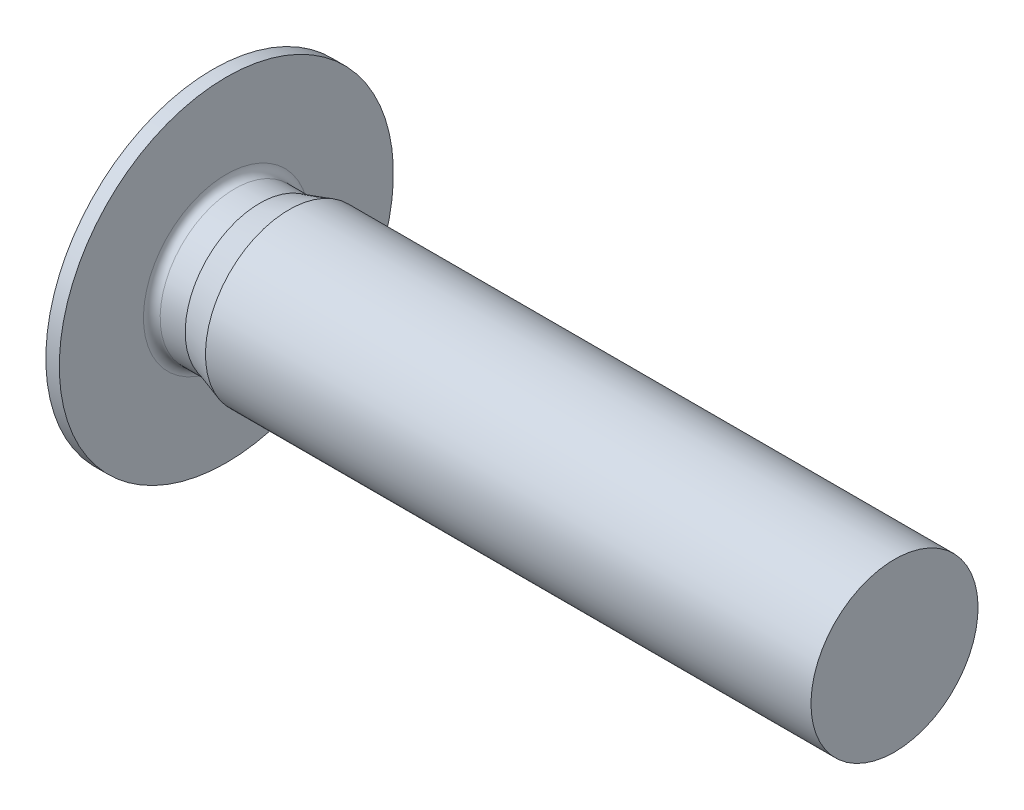
ISO-10303-21;
HEADER;
FILE_DESCRIPTION(('STEP AP214'),'2;1');
FILE_NAME('part.step','',(''),(''),'','','');
FILE_SCHEMA(('AUTOMOTIVE_DESIGN { 1 0 10303 214 1 1 1 1 }'));
ENDSEC;
DATA;
#1=APPLICATION_CONTEXT('core data for automotive mechanical design processes');
#2=APPLICATION_PROTOCOL_DEFINITION('international standard','automotive_design',2000,#1);
#3=PRODUCT_CONTEXT('',#1,'mechanical');
#4=PRODUCT('Part','Part','',(#3));
#5=PRODUCT_RELATED_PRODUCT_CATEGORY('part','',(#4));
#6=PRODUCT_DEFINITION_FORMATION('','',#4);
#7=PRODUCT_DEFINITION_CONTEXT('part definition',#1,'design');
#8=PRODUCT_DEFINITION('design','',#6,#7);
#9=PRODUCT_DEFINITION_SHAPE('','',#8);
#10=(LENGTH_UNIT() NAMED_UNIT(*) SI_UNIT(.MILLI.,.METRE.));
#11=(NAMED_UNIT(*) PLANE_ANGLE_UNIT() SI_UNIT($,.RADIAN.));
#12=(NAMED_UNIT(*) SI_UNIT($,.STERADIAN.) SOLID_ANGLE_UNIT());
#13=UNCERTAINTY_MEASURE_WITH_UNIT(LENGTH_MEASURE(1.E-05),#10,'distance_accuracy_value','');
#14=(GEOMETRIC_REPRESENTATION_CONTEXT(3) GLOBAL_UNCERTAINTY_ASSIGNED_CONTEXT((#13)) GLOBAL_UNIT_ASSIGNED_CONTEXT((#10,
#11,#12)) REPRESENTATION_CONTEXT('',''));
#15=CARTESIAN_POINT('',(0.,0.,0.));
#16=DIRECTION('',(0.,0.,1.));
#17=DIRECTION('',(1.,0.,0.));
#18=AXIS2_PLACEMENT_3D('',#15,#16,#17);
#19=CARTESIAN_POINT('',(1.6,0.,0.));
#20=DIRECTION('',(-1.,0.,0.));
#21=DIRECTION('',(0.,0.,1.));
#22=AXIS2_PLACEMENT_3D('',#19,#20,#21);
#23=PLANE('',#22);
#24=CARTESIAN_POINT('',(1.6,0.,0.));
#25=DIRECTION('',(-1.,0.,0.));
#26=DIRECTION('',(0.,-1.,0.));
#27=AXIS2_PLACEMENT_3D('',#24,#25,#26);
#28=CIRCLE('',#27,1.);
#29=CARTESIAN_POINT('',(1.6,-0.866025403784439,0.5));
#30=VERTEX_POINT('',#29);
#31=CARTESIAN_POINT('',(1.6,0.,1.));
#32=VERTEX_POINT('',#31);
#33=EDGE_CURVE('E47',#30,#32,#28,.T.);
#34=ORIENTED_EDGE('',*,*,#33,.F.);
#35=DIRECTION('',(0.,0.5,0.866025403784439));
#36=VECTOR('',#35,1.);
#37=CARTESIAN_POINT('',(1.6,-1.15470053837925,0.));
#38=LINE('',#37,#36);
#39=CARTESIAN_POINT('',(1.6,-0.577350269189627,1.));
#40=VERTEX_POINT('',#39);
#41=EDGE_CURVE('E262',#30,#40,#38,.T.);
#42=ORIENTED_EDGE('',*,*,#41,.T.);
#43=DIRECTION('',(0.,1.,0.));
#44=VECTOR('',#43,1.);
#45=CARTESIAN_POINT('',(1.6,-0.577350269189627,1.));
#46=LINE('',#45,#44);
#47=EDGE_CURVE('E230',#40,#32,#46,.T.);
#48=ORIENTED_EDGE('',*,*,#47,.T.);
#49=EDGE_LOOP('',(#34,#42,#48));
#50=FACE_BOUND('',#49,.T.);
#51=ADVANCED_FACE('F36',(#50),#23,.T.);
#52=CARTESIAN_POINT('',(1.6,0.866025403784439,0.5));
#53=VERTEX_POINT('',#52);
#54=EDGE_CURVE('E11',#32,#53,#28,.T.);
#55=ORIENTED_EDGE('',*,*,#54,.F.);
#56=CARTESIAN_POINT('',(1.6,0.577350269189626,1.));
#57=VERTEX_POINT('',#56);
#58=EDGE_CURVE('E255',#32,#57,#46,.T.);
#59=ORIENTED_EDGE('',*,*,#58,.T.);
#60=DIRECTION('',(0.,0.5,-0.866025403784439));
#61=VECTOR('',#60,1.);
#62=CARTESIAN_POINT('',(1.6,0.577350269189626,1.));
#63=LINE('',#62,#61);
#64=EDGE_CURVE('E276',#57,#53,#63,.T.);
#65=ORIENTED_EDGE('',*,*,#64,.T.);
#66=EDGE_LOOP('',(#55,#59,#65));
#67=FACE_BOUND('',#66,.T.);
#68=ADVANCED_FACE('F123',(#67),#23,.T.);
#69=CARTESIAN_POINT('',(1.6,0.866025403784439,-0.5));
#70=VERTEX_POINT('',#69);
#71=EDGE_CURVE('E45',#53,#70,#28,.T.);
#72=ORIENTED_EDGE('',*,*,#71,.F.);
#73=CARTESIAN_POINT('',(1.6,1.15470053837925,0.));
#74=VERTEX_POINT('',#73);
#75=EDGE_CURVE('E243',#53,#74,#63,.T.);
#76=ORIENTED_EDGE('',*,*,#75,.T.);
#77=DIRECTION('',(0.,-0.5,-0.866025403784439));
#78=VECTOR('',#77,1.);
#79=CARTESIAN_POINT('',(1.6,1.15470053837925,0.));
#80=LINE('',#79,#78);
#81=EDGE_CURVE('E273',#74,#70,#80,.T.);
#82=ORIENTED_EDGE('',*,*,#81,.T.);
#83=EDGE_LOOP('',(#72,#76,#82));
#84=FACE_BOUND('',#83,.T.);
#85=ADVANCED_FACE('F128',(#84),#23,.T.);
#86=CARTESIAN_POINT('',(1.6,0.,-1.));
#87=VERTEX_POINT('',#86);
#88=EDGE_CURVE('E221',#70,#87,#28,.T.);
#89=ORIENTED_EDGE('',*,*,#88,.F.);
#90=CARTESIAN_POINT('',(1.6,0.577350269189626,-1.));
#91=VERTEX_POINT('',#90);
#92=EDGE_CURVE('E275',#70,#91,#80,.T.);
#93=ORIENTED_EDGE('',*,*,#92,.T.);
#94=DIRECTION('',(0.,-1.,0.));
#95=VECTOR('',#94,1.);
#96=CARTESIAN_POINT('',(1.6,0.577350269189626,-1.));
#97=LINE('',#96,#95);
#98=EDGE_CURVE('E269',#91,#87,#97,.T.);
#99=ORIENTED_EDGE('',*,*,#98,.T.);
#100=EDGE_LOOP('',(#89,#93,#99));
#101=FACE_BOUND('',#100,.T.);
#102=ADVANCED_FACE('F187',(#101),#23,.T.);
#103=CARTESIAN_POINT('',(1.6,-0.866025403784439,-0.5));
#104=VERTEX_POINT('',#103);
#105=EDGE_CURVE('E54',#87,#104,#28,.T.);
#106=ORIENTED_EDGE('',*,*,#105,.F.);
#107=CARTESIAN_POINT('',(1.6,-0.577350269189626,-1.));
#108=VERTEX_POINT('',#107);
#109=EDGE_CURVE('E272',#87,#108,#97,.T.);
#110=ORIENTED_EDGE('',*,*,#109,.T.);
#111=DIRECTION('',(0.,-0.5,0.866025403784438));
#112=VECTOR('',#111,1.);
#113=CARTESIAN_POINT('',(1.6,-0.577350269189626,-1.));
#114=LINE('',#113,#112);
#115=EDGE_CURVE('E264',#108,#104,#114,.T.);
#116=ORIENTED_EDGE('',*,*,#115,.T.);
#117=EDGE_LOOP('',(#106,#110,#116));
#118=FACE_BOUND('',#117,.T.);
#119=ADVANCED_FACE('F121',(#118),#23,.T.);
#120=CARTESIAN_POINT('',(-0.9,0.,0.));
#121=DIRECTION('',(-1.,0.,0.));
#122=DIRECTION('',(0.,-1.,0.));
#123=AXIS2_PLACEMENT_3D('',#120,#121,#122);
#124=CYLINDRICAL_SURFACE('',#123,1.785);
#125=CARTESIAN_POINT('',(0.2,0.,0.));
#126=DIRECTION('',(-1.,0.,0.));
#127=DIRECTION('',(0.,-1.,0.));
#128=AXIS2_PLACEMENT_3D('',#125,#126,#127);
#129=CIRCLE('',#128,1.785);
#130=CARTESIAN_POINT('',(0.2,-1.785,0.));
#131=VERTEX_POINT('',#130);
#132=EDGE_CURVE('E40',#131,#131,#129,.F.);
#133=ORIENTED_EDGE('',*,*,#132,.T.);
#134=EDGE_LOOP('',(#133));
#135=FACE_BOUND('',#134,.T.);
#136=CARTESIAN_POINT('',(0.8,0.,0.));
#137=DIRECTION('',(-1.,0.,0.));
#138=DIRECTION('',(0.,-1.,0.));
#139=AXIS2_PLACEMENT_3D('',#136,#137,#138);
#140=CIRCLE('',#139,1.785);
#141=CARTESIAN_POINT('',(0.8,-1.785,0.));
#142=VERTEX_POINT('',#141);
#143=EDGE_CURVE('E194',#142,#142,#140,.T.);
#144=ORIENTED_EDGE('',*,*,#143,.T.);
#145=EDGE_LOOP('',(#144));
#146=FACE_BOUND('',#145,.T.);
#147=ADVANCED_FACE('F180',(#135,#146),#124,.T.);
#148=CARTESIAN_POINT('',(0.,4.,0.));
#149=DIRECTION('',(-1.,0.,0.));
#150=DIRECTION('',(0.,-1.,0.));
#151=AXIS2_PLACEMENT_3D('',#148,#149,#150);
#152=PLANE('',#151);
#153=CARTESIAN_POINT('',(0.,0.,0.));
#154=DIRECTION('',(-1.,0.,0.));
#155=DIRECTION('',(0.,-1.,0.));
#156=AXIS2_PLACEMENT_3D('',#153,#154,#155);
#157=CIRCLE('',#156,1.985);
#158=CARTESIAN_POINT('',(0.,-1.985,0.));
#159=VERTEX_POINT('',#158);
#160=EDGE_CURVE('E217',#159,#159,#157,.T.);
#161=ORIENTED_EDGE('',*,*,#160,.T.);
#162=EDGE_LOOP('',(#161));
#163=FACE_BOUND('',#162,.T.);
#164=CARTESIAN_POINT('',(0.,0.,0.));
#165=DIRECTION('',(-1.,0.,0.));
#166=DIRECTION('',(0.,-1.,0.));
#167=AXIS2_PLACEMENT_3D('',#164,#165,#166);
#168=CIRCLE('',#167,4.);
#169=CARTESIAN_POINT('',(0.,-4.,0.));
#170=VERTEX_POINT('',#169);
#171=EDGE_CURVE('E215',#170,#170,#168,.T.);
#172=ORIENTED_EDGE('',*,*,#171,.F.);
#173=EDGE_LOOP('',(#172));
#174=FACE_BOUND('',#173,.T.);
#175=ADVANCED_FACE('F177',(#163,#174),#152,.F.);
#176=CARTESIAN_POINT('',(-0.9,0.,0.));
#177=DIRECTION('',(-1.,0.,0.));
#178=DIRECTION('',(0.,-1.,0.));
#179=AXIS2_PLACEMENT_3D('',#176,#177,#178);
#180=CYLINDRICAL_SURFACE('',#179,4.);
#181=CARTESIAN_POINT('',(-0.322649730810382,0.,0.));
#182=DIRECTION('',(-1.,0.,0.));
#183=DIRECTION('',(0.,-1.,0.));
#184=AXIS2_PLACEMENT_3D('',#181,#182,#183);
#185=CIRCLE('',#184,4.);
#186=CARTESIAN_POINT('',(-0.322649730810382,-4.,0.));
#187=VERTEX_POINT('',#186);
#188=EDGE_CURVE('E212',#187,#187,#185,.T.);
#189=ORIENTED_EDGE('',*,*,#188,.F.);
#190=EDGE_LOOP('',(#189));
#191=FACE_BOUND('',#190,.T.);
#192=ORIENTED_EDGE('',*,*,#171,.T.);
#193=EDGE_LOOP('',(#192));
#194=FACE_BOUND('',#193,.T.);
#195=ADVANCED_FACE('F173',(#191,#194),#180,.T.);
#196=CARTESIAN_POINT('',(-0.322649730810382,0.,0.));
#197=DIRECTION('',(1.,0.,0.));
#198=DIRECTION('',(0.,1.,0.));
#199=AXIS2_PLACEMENT_3D('',#196,#197,#198);
#200=CONICAL_SURFACE('',#199,4.,1.0471975511966);
#201=CARTESIAN_POINT('',(-0.9,0.,0.));
#202=DIRECTION('',(-1.,0.,0.));
#203=DIRECTION('',(0.,-1.,0.));
#204=AXIS2_PLACEMENT_3D('',#201,#202,#203);
#205=CIRCLE('',#204,3.);
#206=CARTESIAN_POINT('',(-0.9,-3.,0.));
#207=VERTEX_POINT('',#206);
#208=EDGE_CURVE('E209',#207,#207,#205,.T.);
#209=ORIENTED_EDGE('',*,*,#208,.F.);
#210=EDGE_LOOP('',(#209));
#211=FACE_BOUND('',#210,.T.);
#212=ORIENTED_EDGE('',*,*,#188,.T.);
#213=EDGE_LOOP('',(#212));
#214=FACE_BOUND('',#213,.T.);
#215=ADVANCED_FACE('F169',(#211,#214),#200,.T.);
#216=CARTESIAN_POINT('',(-0.9,0.,0.));
#217=DIRECTION('',(1.,0.,0.));
#218=DIRECTION('',(0.,1.,0.));
#219=AXIS2_PLACEMENT_3D('',#216,#217,#218);
#220=PLANE('',#219);
#221=DIRECTION('',(0.,-0.5,-0.866025403784439));
#222=VECTOR('',#221,1.);
#223=CARTESIAN_POINT('',(-0.9,1.15470053837925,0.));
#224=LINE('',#223,#222);
#225=CARTESIAN_POINT('',(-0.9,1.15470053837925,0.));
#226=VERTEX_POINT('',#225);
#227=CARTESIAN_POINT('',(-0.9,0.577350269189626,-1.));
#228=VERTEX_POINT('',#227);
#229=EDGE_CURVE('E224',#226,#228,#224,.T.);
#230=ORIENTED_EDGE('',*,*,#229,.F.);
#231=DIRECTION('',(0.,0.5,-0.866025403784439));
#232=VECTOR('',#231,1.);
#233=CARTESIAN_POINT('',(-0.9,0.577350269189626,1.));
#234=LINE('',#233,#232);
#235=CARTESIAN_POINT('',(-0.9,0.577350269189626,1.));
#236=VERTEX_POINT('',#235);
#237=EDGE_CURVE('E62',#236,#226,#234,.T.);
#238=ORIENTED_EDGE('',*,*,#237,.F.);
#239=DIRECTION('',(0.,1.,0.));
#240=VECTOR('',#239,1.);
#241=CARTESIAN_POINT('',(-0.9,-0.577350269189627,1.));
#242=LINE('',#241,#240);
#243=CARTESIAN_POINT('',(-0.9,-0.577350269189627,1.));
#244=VERTEX_POINT('',#243);
#245=EDGE_CURVE('E241',#244,#236,#242,.T.);
#246=ORIENTED_EDGE('',*,*,#245,.F.);
#247=DIRECTION('',(0.,0.5,0.866025403784439));
#248=VECTOR('',#247,1.);
#249=CARTESIAN_POINT('',(-0.9,-1.15470053837925,0.));
#250=LINE('',#249,#248);
#251=CARTESIAN_POINT('',(-0.9,-1.15470053837925,0.));
#252=VERTEX_POINT('',#251);
#253=EDGE_CURVE('E238',#252,#244,#250,.T.);
#254=ORIENTED_EDGE('',*,*,#253,.F.);
#255=DIRECTION('',(0.,-0.5,0.866025403784438));
#256=VECTOR('',#255,1.);
#257=CARTESIAN_POINT('',(-0.9,-0.577350269189626,-1.));
#258=LINE('',#257,#256);
#259=CARTESIAN_POINT('',(-0.9,-0.577350269189626,-1.));
#260=VERTEX_POINT('',#259);
#261=EDGE_CURVE('E235',#260,#252,#258,.T.);
#262=ORIENTED_EDGE('',*,*,#261,.F.);
#263=DIRECTION('',(0.,-1.,0.));
#264=VECTOR('',#263,1.);
#265=CARTESIAN_POINT('',(-0.9,0.577350269189626,-1.));
#266=LINE('',#265,#264);
#267=EDGE_CURVE('E227',#228,#260,#266,.T.);
#268=ORIENTED_EDGE('',*,*,#267,.F.);
#269=EDGE_LOOP('',(#230,#238,#246,#254,#262,#268));
#270=FACE_BOUND('',#269,.T.);
#271=ORIENTED_EDGE('',*,*,#208,.T.);
#272=EDGE_LOOP('',(#271));
#273=FACE_BOUND('',#272,.T.);
#274=ADVANCED_FACE('F165',(#270,#273),#220,.F.);
#275=CARTESIAN_POINT('',(16.,2.,0.));
#276=DIRECTION('',(-1.,0.,0.));
#277=DIRECTION('',(0.,-1.,0.));
#278=AXIS2_PLACEMENT_3D('',#275,#276,#277);
#279=PLANE('',#278);
#280=CARTESIAN_POINT('',(16.,0.,0.));
#281=DIRECTION('',(-1.,0.,0.));
#282=DIRECTION('',(0.,-1.,0.));
#283=AXIS2_PLACEMENT_3D('',#280,#281,#282);
#284=CIRCLE('',#283,2.);
#285=CARTESIAN_POINT('',(16.,-2.,0.));
#286=VERTEX_POINT('',#285);
#287=EDGE_CURVE('E199',#286,#286,#284,.T.);
#288=ORIENTED_EDGE('',*,*,#287,.F.);
#289=EDGE_LOOP('',(#288));
#290=FACE_BOUND('',#289,.T.);
#291=ADVANCED_FACE('F161',(#290),#279,.F.);
#292=CARTESIAN_POINT('',(-0.9,0.,0.));
#293=DIRECTION('',(-1.,0.,0.));
#294=DIRECTION('',(0.,-1.,0.));
#295=AXIS2_PLACEMENT_3D('',#292,#293,#294);
#296=CYLINDRICAL_SURFACE('',#295,2.);
#297=CARTESIAN_POINT('',(1.5,0.,0.));
#298=DIRECTION('',(-1.,0.,0.));
#299=DIRECTION('',(0.,-1.,0.));
#300=AXIS2_PLACEMENT_3D('',#297,#298,#299);
#301=CIRCLE('',#300,2.);
#302=CARTESIAN_POINT('',(1.5,-2.,0.));
#303=VERTEX_POINT('',#302);
#304=EDGE_CURVE('E195',#303,#303,#301,.T.);
#305=ORIENTED_EDGE('',*,*,#304,.F.);
#306=EDGE_LOOP('',(#305));
#307=FACE_BOUND('',#306,.T.);
#308=ORIENTED_EDGE('',*,*,#287,.T.);
#309=EDGE_LOOP('',(#308));
#310=FACE_BOUND('',#309,.T.);
#311=ADVANCED_FACE('F157',(#307,#310),#296,.T.);
#312=CARTESIAN_POINT('',(1.5,0.,0.));
#313=DIRECTION('',(1.,0.,0.));
#314=DIRECTION('',(0.,1.,0.));
#315=AXIS2_PLACEMENT_3D('',#312,#313,#314);
#316=CONICAL_SURFACE('',#315,2.,0.297996923596222);
#317=ORIENTED_EDGE('',*,*,#143,.F.);
#318=EDGE_LOOP('',(#317));
#319=FACE_BOUND('',#318,.T.);
#320=ORIENTED_EDGE('',*,*,#304,.T.);
#321=EDGE_LOOP('',(#320));
#322=FACE_BOUND('',#321,.T.);
#323=ADVANCED_FACE('F154',(#319,#322),#316,.T.);
#324=CARTESIAN_POINT('',(0.2,0.,0.));
#325=DIRECTION('',(-1.,0.,0.));
#326=DIRECTION('',(0.,-1.,0.));
#327=AXIS2_PLACEMENT_3D('',#324,#325,#326);
#328=TOROIDAL_SURFACE('',#327,1.985,0.2);
#329=ORIENTED_EDGE('',*,*,#132,.F.);
#330=EDGE_LOOP('',(#329));
#331=FACE_BOUND('',#330,.T.);
#332=ORIENTED_EDGE('',*,*,#160,.F.);
#333=EDGE_LOOP('',(#332));
#334=FACE_BOUND('',#333,.T.);
#335=ADVANCED_FACE('F38',(#331,#334),#328,.F.);
#336=CARTESIAN_POINT('',(1.6,0.577350269189626,1.));
#337=DIRECTION('',(0.,0.866025403784439,0.5));
#338=DIRECTION('',(0.,-0.5,0.866025403784439));
#339=AXIS2_PLACEMENT_3D('',#336,#337,#338);
#340=PLANE('',#339);
#341=ORIENTED_EDGE('',*,*,#237,.T.);
#342=DIRECTION('',(-1.,0.,0.));
#343=VECTOR('',#342,1.);
#344=CARTESIAN_POINT('',(1.6,1.15470053837925,0.));
#345=LINE('',#344,#343);
#346=EDGE_CURVE('E204',#74,#226,#345,.T.);
#347=ORIENTED_EDGE('',*,*,#346,.F.);
#348=ORIENTED_EDGE('',*,*,#75,.F.);
#349=ORIENTED_EDGE('',*,*,#64,.F.);
#350=DIRECTION('',(-1.,0.,0.));
#351=VECTOR('',#350,1.);
#352=CARTESIAN_POINT('',(1.6,0.577350269189626,1.));
#353=LINE('',#352,#351);
#354=EDGE_CURVE('E196',#57,#236,#353,.T.);
#355=ORIENTED_EDGE('',*,*,#354,.T.);
#356=EDGE_LOOP('',(#341,#347,#348,#349,#355));
#357=FACE_BOUND('',#356,.T.);
#358=ADVANCED_FACE('F136',(#357),#340,.F.);
#359=CARTESIAN_POINT('',(1.6,-0.577350269189627,1.));
#360=DIRECTION('',(0.,0.,1.));
#361=DIRECTION('',(1.,0.,0.));
#362=AXIS2_PLACEMENT_3D('',#359,#360,#361);
#363=PLANE('',#362);
#364=ORIENTED_EDGE('',*,*,#245,.T.);
#365=ORIENTED_EDGE('',*,*,#354,.F.);
#366=ORIENTED_EDGE('',*,*,#58,.F.);
#367=ORIENTED_EDGE('',*,*,#47,.F.);
#368=DIRECTION('',(-1.,0.,0.));
#369=VECTOR('',#368,1.);
#370=CARTESIAN_POINT('',(1.6,-0.577350269189627,1.));
#371=LINE('',#370,#369);
#372=EDGE_CURVE('E201',#40,#244,#371,.T.);
#373=ORIENTED_EDGE('',*,*,#372,.T.);
#374=EDGE_LOOP('',(#364,#365,#366,#367,#373));
#375=FACE_BOUND('',#374,.T.);
#376=ADVANCED_FACE('F132',(#375),#363,.F.);
#377=CARTESIAN_POINT('',(1.6,-1.15470053837925,0.));
#378=DIRECTION('',(0.,-0.866025403784439,0.5));
#379=DIRECTION('',(0.,-0.5,-0.866025403784439));
#380=AXIS2_PLACEMENT_3D('',#377,#378,#379);
#381=PLANE('',#380);
#382=ORIENTED_EDGE('',*,*,#253,.T.);
#383=ORIENTED_EDGE('',*,*,#372,.F.);
#384=ORIENTED_EDGE('',*,*,#41,.F.);
#385=CARTESIAN_POINT('',(1.6,-1.15470053837925,0.));
#386=VERTEX_POINT('',#385);
#387=EDGE_CURVE('E257',#386,#30,#38,.T.);
#388=ORIENTED_EDGE('',*,*,#387,.F.);
#389=DIRECTION('',(-1.,0.,0.));
#390=VECTOR('',#389,1.);
#391=CARTESIAN_POINT('',(1.6,-1.15470053837925,0.));
#392=LINE('',#391,#390);
#393=EDGE_CURVE('E246',#386,#252,#392,.T.);
#394=ORIENTED_EDGE('',*,*,#393,.T.);
#395=EDGE_LOOP('',(#382,#383,#384,#388,#394));
#396=FACE_BOUND('',#395,.T.);
#397=ADVANCED_FACE('F135',(#396),#381,.F.);
#398=CARTESIAN_POINT('',(1.6,-0.577350269189626,-1.));
#399=DIRECTION('',(0.,-0.866025403784439,-0.5));
#400=DIRECTION('',(0.,0.5,-0.866025403784439));
#401=AXIS2_PLACEMENT_3D('',#398,#399,#400);
#402=PLANE('',#401);
#403=ORIENTED_EDGE('',*,*,#261,.T.);
#404=ORIENTED_EDGE('',*,*,#393,.F.);
#405=EDGE_CURVE('E268',#104,#386,#114,.T.);
#406=ORIENTED_EDGE('',*,*,#405,.F.);
#407=ORIENTED_EDGE('',*,*,#115,.F.);
#408=DIRECTION('',(-1.,0.,0.));
#409=VECTOR('',#408,1.);
#410=CARTESIAN_POINT('',(1.6,-0.577350269189626,-1.));
#411=LINE('',#410,#409);
#412=EDGE_CURVE('E248',#108,#260,#411,.T.);
#413=ORIENTED_EDGE('',*,*,#412,.T.);
#414=EDGE_LOOP('',(#403,#404,#406,#407,#413));
#415=FACE_BOUND('',#414,.T.);
#416=ADVANCED_FACE('F140',(#415),#402,.F.);
#417=CARTESIAN_POINT('',(1.6,0.577350269189626,-1.));
#418=DIRECTION('',(0.,0.,-1.));
#419=DIRECTION('',(-1.,0.,0.));
#420=AXIS2_PLACEMENT_3D('',#417,#418,#419);
#421=PLANE('',#420);
#422=ORIENTED_EDGE('',*,*,#267,.T.);
#423=ORIENTED_EDGE('',*,*,#412,.F.);
#424=ORIENTED_EDGE('',*,*,#109,.F.);
#425=ORIENTED_EDGE('',*,*,#98,.F.);
#426=DIRECTION('',(-1.,0.,0.));
#427=VECTOR('',#426,1.);
#428=CARTESIAN_POINT('',(1.6,0.577350269189626,-1.));
#429=LINE('',#428,#427);
#430=EDGE_CURVE('E249',#91,#228,#429,.T.);
#431=ORIENTED_EDGE('',*,*,#430,.T.);
#432=EDGE_LOOP('',(#422,#423,#424,#425,#431));
#433=FACE_BOUND('',#432,.T.);
#434=ADVANCED_FACE('F144',(#433),#421,.F.);
#435=CARTESIAN_POINT('',(1.6,1.15470053837925,0.));
#436=DIRECTION('',(0.,0.866025403784439,-0.5));
#437=DIRECTION('',(0.,0.5,0.866025403784439));
#438=AXIS2_PLACEMENT_3D('',#435,#436,#437);
#439=PLANE('',#438);
#440=ORIENTED_EDGE('',*,*,#229,.T.);
#441=ORIENTED_EDGE('',*,*,#430,.F.);
#442=ORIENTED_EDGE('',*,*,#92,.F.);
#443=ORIENTED_EDGE('',*,*,#81,.F.);
#444=ORIENTED_EDGE('',*,*,#346,.T.);
#445=EDGE_LOOP('',(#440,#441,#442,#443,#444));
#446=FACE_BOUND('',#445,.T.);
#447=ADVANCED_FACE('F118',(#446),#439,.F.);
#448=EDGE_CURVE('E220',#104,#30,#28,.T.);
#449=ORIENTED_EDGE('',*,*,#448,.F.);
#450=ORIENTED_EDGE('',*,*,#405,.T.);
#451=ORIENTED_EDGE('',*,*,#387,.T.);
#452=EDGE_LOOP('',(#449,#450,#451));
#453=FACE_BOUND('',#452,.T.);
#454=ADVANCED_FACE('F113',(#453),#23,.T.);
#455=CARTESIAN_POINT('',(2.20086061902756,0.,0.));
#456=DIRECTION('',(-1.,0.,0.));
#457=DIRECTION('',(0.,-1.,0.));
#458=AXIS2_PLACEMENT_3D('',#455,#456,#457);
#459=CONICAL_SURFACE('',#458,0.,1.02974425867666);
#460=ORIENTED_EDGE('',*,*,#33,.T.);
#461=ORIENTED_EDGE('',*,*,#54,.T.);
#462=ORIENTED_EDGE('',*,*,#71,.T.);
#463=ORIENTED_EDGE('',*,*,#88,.T.);
#464=ORIENTED_EDGE('',*,*,#105,.T.);
#465=ORIENTED_EDGE('',*,*,#448,.T.);
#466=EDGE_LOOP('',(#460,#461,#462,#463,#464,#465));
#467=FACE_BOUND('',#466,.T.);
#468=CARTESIAN_POINT('',(2.20086061902756,0.,0.));
#469=VERTEX_POINT('',#468);
#470=VERTEX_LOOP('',#469);
#471=FACE_BOUND('',#470,.T.);
#472=ADVANCED_FACE('F111',(#467,#471),#459,.F.);
#473=CLOSED_SHELL('',(#51,#68,#85,#102,#119,#147,#175,#195,#215,#274,#291,#311,#323,#335,#358,
#376,#397,#416,#434,#447,#454,#472));
#474=MANIFOLD_SOLID_BREP('B2',#473);
#475=ADVANCED_BREP_SHAPE_REPRESENTATION('',(#18,#474),#14);
#476=SHAPE_DEFINITION_REPRESENTATION(#9,#475);
ENDSEC;
END-ISO-10303-21;
